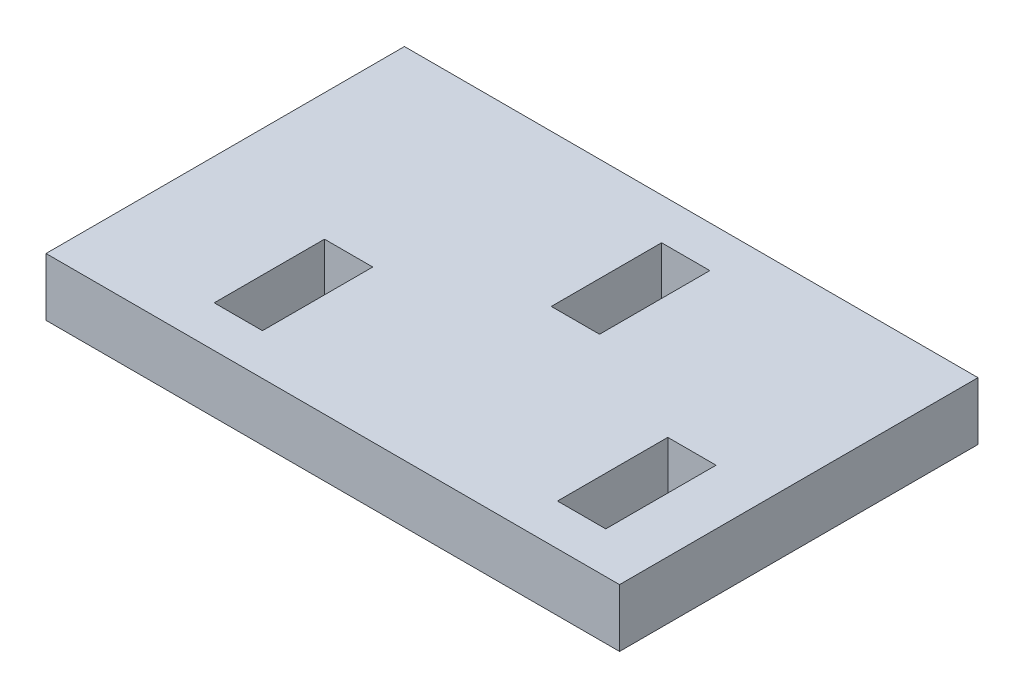
ISO-10303-21;
HEADER;
FILE_DESCRIPTION(('STEP AP214'),'2;1');
FILE_NAME('part.step','',(''),(''),'','','');
FILE_SCHEMA(('AUTOMOTIVE_DESIGN { 1 0 10303 214 1 1 1 1 }'));
ENDSEC;
DATA;
#1=APPLICATION_CONTEXT('core data for automotive mechanical design processes');
#2=APPLICATION_PROTOCOL_DEFINITION('international standard','automotive_design',2000,#1);
#3=PRODUCT_CONTEXT('',#1,'mechanical');
#4=PRODUCT('Part','Part','',(#3));
#5=PRODUCT_RELATED_PRODUCT_CATEGORY('part','',(#4));
#6=PRODUCT_DEFINITION_FORMATION('','',#4);
#7=PRODUCT_DEFINITION_CONTEXT('part definition',#1,'design');
#8=PRODUCT_DEFINITION('design','',#6,#7);
#9=PRODUCT_DEFINITION_SHAPE('','',#8);
#10=(LENGTH_UNIT() NAMED_UNIT(*) SI_UNIT(.MILLI.,.METRE.));
#11=(NAMED_UNIT(*) PLANE_ANGLE_UNIT() SI_UNIT($,.RADIAN.));
#12=(NAMED_UNIT(*) SI_UNIT($,.STERADIAN.) SOLID_ANGLE_UNIT());
#13=UNCERTAINTY_MEASURE_WITH_UNIT(LENGTH_MEASURE(1.E-05),#10,'distance_accuracy_value','');
#14=(GEOMETRIC_REPRESENTATION_CONTEXT(3) GLOBAL_UNCERTAINTY_ASSIGNED_CONTEXT((#13)) GLOBAL_UNIT_ASSIGNED_CONTEXT((#10,
#11,#12)) REPRESENTATION_CONTEXT('',''));
#15=CARTESIAN_POINT('',(0.,0.,0.));
#16=DIRECTION('',(0.,0.,1.));
#17=DIRECTION('',(1.,0.,0.));
#18=AXIS2_PLACEMENT_3D('',#15,#16,#17);
#19=CARTESIAN_POINT('',(26.416,5.334,16.51));
#20=DIRECTION('',(-1.,0.,0.));
#21=DIRECTION('',(0.,0.,1.));
#22=AXIS2_PLACEMENT_3D('',#19,#20,#21);
#23=PLANE('',#22);
#24=DIRECTION('',(0.,0.,-1.));
#25=VECTOR('',#24,1.);
#26=CARTESIAN_POINT('',(26.416,0.,16.51));
#27=LINE('',#26,#25);
#28=CARTESIAN_POINT('',(26.416,0.,16.51));
#29=VERTEX_POINT('',#28);
#30=CARTESIAN_POINT('',(26.416,0.,-16.51));
#31=VERTEX_POINT('',#30);
#32=EDGE_CURVE('E240',#29,#31,#27,.T.);
#33=ORIENTED_EDGE('',*,*,#32,.T.);
#34=DIRECTION('',(0.,-1.,0.));
#35=VECTOR('',#34,1.);
#36=CARTESIAN_POINT('',(26.416,5.334,-16.51));
#37=LINE('',#36,#35);
#38=CARTESIAN_POINT('',(26.416,5.334,-16.51));
#39=VERTEX_POINT('',#38);
#40=EDGE_CURVE('E11',#39,#31,#37,.T.);
#41=ORIENTED_EDGE('',*,*,#40,.F.);
#42=DIRECTION('',(0.,0.,-1.));
#43=VECTOR('',#42,1.);
#44=CARTESIAN_POINT('',(26.416,5.334,16.51));
#45=LINE('',#44,#43);
#46=CARTESIAN_POINT('',(26.416,5.334,16.51));
#47=VERTEX_POINT('',#46);
#48=EDGE_CURVE('E247',#47,#39,#45,.T.);
#49=ORIENTED_EDGE('',*,*,#48,.F.);
#50=DIRECTION('',(0.,-1.,0.));
#51=VECTOR('',#50,1.);
#52=CARTESIAN_POINT('',(26.416,5.334,16.51));
#53=LINE('',#52,#51);
#54=EDGE_CURVE('E257',#47,#29,#53,.T.);
#55=ORIENTED_EDGE('',*,*,#54,.T.);
#56=EDGE_LOOP('',(#33,#41,#49,#55));
#57=FACE_BOUND('',#56,.T.);
#58=ADVANCED_FACE('F34',(#57),#23,.F.);
#59=CARTESIAN_POINT('',(-26.416,5.334,-16.51));
#60=DIRECTION('',(0.,0.,1.));
#61=DIRECTION('',(1.,0.,0.));
#62=AXIS2_PLACEMENT_3D('',#59,#60,#61);
#63=PLANE('',#62);
#64=DIRECTION('',(-1.,0.,0.));
#65=VECTOR('',#64,1.);
#66=CARTESIAN_POINT('',(-26.416,0.,-16.51));
#67=LINE('',#66,#65);
#68=CARTESIAN_POINT('',(-26.416,0.,-16.51));
#69=VERTEX_POINT('',#68);
#70=EDGE_CURVE('E260',#31,#69,#67,.T.);
#71=ORIENTED_EDGE('',*,*,#70,.T.);
#72=DIRECTION('',(0.,-1.,0.));
#73=VECTOR('',#72,1.);
#74=CARTESIAN_POINT('',(-26.416,5.334,-16.51));
#75=LINE('',#74,#73);
#76=CARTESIAN_POINT('',(-26.416,5.334,-16.51));
#77=VERTEX_POINT('',#76);
#78=EDGE_CURVE('E41',#77,#69,#75,.T.);
#79=ORIENTED_EDGE('',*,*,#78,.F.);
#80=DIRECTION('',(-1.,0.,0.));
#81=VECTOR('',#80,1.);
#82=CARTESIAN_POINT('',(-26.416,5.334,-16.51));
#83=LINE('',#82,#81);
#84=EDGE_CURVE('E250',#39,#77,#83,.T.);
#85=ORIENTED_EDGE('',*,*,#84,.F.);
#86=ORIENTED_EDGE('',*,*,#40,.T.);
#87=EDGE_LOOP('',(#71,#79,#85,#86));
#88=FACE_BOUND('',#87,.T.);
#89=ADVANCED_FACE('F289',(#88),#63,.F.);
#90=CARTESIAN_POINT('',(-26.416,5.334,16.51));
#91=DIRECTION('',(1.,0.,0.));
#92=DIRECTION('',(0.,0.,-1.));
#93=AXIS2_PLACEMENT_3D('',#90,#91,#92);
#94=PLANE('',#93);
#95=DIRECTION('',(0.,0.,1.));
#96=VECTOR('',#95,1.);
#97=CARTESIAN_POINT('',(-26.416,0.,16.51));
#98=LINE('',#97,#96);
#99=CARTESIAN_POINT('',(-26.416,0.,16.51));
#100=VERTEX_POINT('',#99);
#101=EDGE_CURVE('E262',#69,#100,#98,.T.);
#102=ORIENTED_EDGE('',*,*,#101,.T.);
#103=DIRECTION('',(0.,-1.,0.));
#104=VECTOR('',#103,1.);
#105=CARTESIAN_POINT('',(-26.416,5.334,16.51));
#106=LINE('',#105,#104);
#107=CARTESIAN_POINT('',(-26.416,5.334,16.51));
#108=VERTEX_POINT('',#107);
#109=EDGE_CURVE('E267',#108,#100,#106,.T.);
#110=ORIENTED_EDGE('',*,*,#109,.F.);
#111=DIRECTION('',(0.,0.,1.));
#112=VECTOR('',#111,1.);
#113=CARTESIAN_POINT('',(-26.416,5.334,16.51));
#114=LINE('',#113,#112);
#115=EDGE_CURVE('E253',#77,#108,#114,.T.);
#116=ORIENTED_EDGE('',*,*,#115,.F.);
#117=ORIENTED_EDGE('',*,*,#78,.T.);
#118=EDGE_LOOP('',(#102,#110,#116,#117));
#119=FACE_BOUND('',#118,.T.);
#120=ADVANCED_FACE('F274',(#119),#94,.F.);
#121=CARTESIAN_POINT('',(-26.416,5.334,16.51));
#122=DIRECTION('',(0.,0.,-1.));
#123=DIRECTION('',(-1.,0.,0.));
#124=AXIS2_PLACEMENT_3D('',#121,#122,#123);
#125=PLANE('',#124);
#126=DIRECTION('',(1.,0.,0.));
#127=VECTOR('',#126,1.);
#128=CARTESIAN_POINT('',(-26.416,0.,16.51));
#129=LINE('',#128,#127);
#130=EDGE_CURVE('E251',#100,#29,#129,.T.);
#131=ORIENTED_EDGE('',*,*,#130,.T.);
#132=ORIENTED_EDGE('',*,*,#54,.F.);
#133=DIRECTION('',(1.,0.,0.));
#134=VECTOR('',#133,1.);
#135=CARTESIAN_POINT('',(-26.416,5.334,16.51));
#136=LINE('',#135,#134);
#137=EDGE_CURVE('E255',#108,#47,#136,.T.);
#138=ORIENTED_EDGE('',*,*,#137,.F.);
#139=ORIENTED_EDGE('',*,*,#109,.T.);
#140=EDGE_LOOP('',(#131,#132,#138,#139));
#141=FACE_BOUND('',#140,.T.);
#142=ADVANCED_FACE('F282',(#141),#125,.F.);
#143=CARTESIAN_POINT('',(26.416,5.334,-16.51));
#144=DIRECTION('',(0.,-1.,0.));
#145=DIRECTION('',(0.,0.,-1.));
#146=AXIS2_PLACEMENT_3D('',#143,#144,#145);
#147=PLANE('',#146);
#148=DIRECTION('',(0.,0.,1.));
#149=VECTOR('',#148,1.);
#150=CARTESIAN_POINT('',(-14.732,5.334,12.6999999999999));
#151=LINE('',#150,#149);
#152=CARTESIAN_POINT('',(-14.7319999999999,5.334,2.53999999999993));
#153=VERTEX_POINT('',#152);
#154=CARTESIAN_POINT('',(-14.732,5.334,12.6999999999999));
#155=VERTEX_POINT('',#154);
#156=EDGE_CURVE('E173',#153,#155,#151,.T.);
#157=ORIENTED_EDGE('',*,*,#156,.F.);
#158=DIRECTION('',(-1.,0.,0.));
#159=VECTOR('',#158,1.);
#160=CARTESIAN_POINT('',(-14.7319999999999,5.334,2.53999999999993));
#161=LINE('',#160,#159);
#162=CARTESIAN_POINT('',(-10.2869999999999,5.334,2.53999999999994));
#163=VERTEX_POINT('',#162);
#164=EDGE_CURVE('E48',#163,#153,#161,.T.);
#165=ORIENTED_EDGE('',*,*,#164,.F.);
#166=DIRECTION('',(0.,0.,-1.));
#167=VECTOR('',#166,1.);
#168=CARTESIAN_POINT('',(-10.2869999999999,5.334,2.53999999999994));
#169=LINE('',#168,#167);
#170=CARTESIAN_POINT('',(-10.287,5.334,12.6999999999999));
#171=VERTEX_POINT('',#170);
#172=EDGE_CURVE('E164',#171,#163,#169,.T.);
#173=ORIENTED_EDGE('',*,*,#172,.F.);
#174=DIRECTION('',(1.,0.,0.));
#175=VECTOR('',#174,1.);
#176=CARTESIAN_POINT('',(-10.287,5.334,12.6999999999999));
#177=LINE('',#176,#175);
#178=EDGE_CURVE('E167',#155,#171,#177,.T.);
#179=ORIENTED_EDGE('',*,*,#178,.F.);
#180=EDGE_LOOP('',(#157,#165,#173,#179));
#181=FACE_BOUND('',#180,.T.);
#182=DIRECTION('',(-1.,0.,0.));
#183=VECTOR('',#182,1.);
#184=CARTESIAN_POINT('',(1.07950000000005,5.334,-12.7));
#185=LINE('',#184,#183);
#186=CARTESIAN_POINT('',(5.52450000000004,5.334,-12.7));
#187=VERTEX_POINT('',#186);
#188=CARTESIAN_POINT('',(1.07950000000005,5.334,-12.7));
#189=VERTEX_POINT('',#188);
#190=EDGE_CURVE('E198',#187,#189,#185,.T.);
#191=ORIENTED_EDGE('',*,*,#190,.F.);
#192=DIRECTION('',(0.,0.,-1.));
#193=VECTOR('',#192,1.);
#194=CARTESIAN_POINT('',(5.52450000000005,5.334,-12.7));
#195=LINE('',#194,#193);
#196=CARTESIAN_POINT('',(5.52450000000004,5.334,-2.54000000000005));
#197=VERTEX_POINT('',#196);
#198=EDGE_CURVE('E179',#197,#187,#195,.T.);
#199=ORIENTED_EDGE('',*,*,#198,.F.);
#200=DIRECTION('',(1.,0.,0.));
#201=VECTOR('',#200,1.);
#202=CARTESIAN_POINT('',(5.52450000000004,5.334,-2.54000000000005));
#203=LINE('',#202,#201);
#204=CARTESIAN_POINT('',(1.07950000000004,5.334,-2.54000000000005));
#205=VERTEX_POINT('',#204);
#206=EDGE_CURVE('E187',#205,#197,#203,.T.);
#207=ORIENTED_EDGE('',*,*,#206,.F.);
#208=DIRECTION('',(0.,0.,1.));
#209=VECTOR('',#208,1.);
#210=CARTESIAN_POINT('',(1.07950000000004,5.334,-2.54000000000005));
#211=LINE('',#210,#209);
#212=EDGE_CURVE('E201',#189,#205,#211,.T.);
#213=ORIENTED_EDGE('',*,*,#212,.F.);
#214=EDGE_LOOP('',(#191,#199,#207,#213));
#215=FACE_BOUND('',#214,.T.);
#216=DIRECTION('',(0.,0.,-1.));
#217=VECTOR('',#216,1.);
#218=CARTESIAN_POINT('',(21.3360000000001,5.334,2.53999999999999));
#219=LINE('',#218,#217);
#220=CARTESIAN_POINT('',(21.336,5.334,12.7));
#221=VERTEX_POINT('',#220);
#222=CARTESIAN_POINT('',(21.3360000000001,5.334,2.53999999999999));
#223=VERTEX_POINT('',#222);
#224=EDGE_CURVE('E230',#221,#223,#219,.T.);
#225=ORIENTED_EDGE('',*,*,#224,.F.);
#226=DIRECTION('',(1.,0.,0.));
#227=VECTOR('',#226,1.);
#228=CARTESIAN_POINT('',(21.336,5.334,12.7));
#229=LINE('',#228,#227);
#230=CARTESIAN_POINT('',(16.891,5.334,12.7));
#231=VERTEX_POINT('',#230);
#232=EDGE_CURVE('E208',#231,#221,#229,.T.);
#233=ORIENTED_EDGE('',*,*,#232,.F.);
#234=DIRECTION('',(0.,0.,1.));
#235=VECTOR('',#234,1.);
#236=CARTESIAN_POINT('',(16.891,5.334,12.7));
#237=LINE('',#236,#235);
#238=CARTESIAN_POINT('',(16.8910000000001,5.334,2.53999999999999));
#239=VERTEX_POINT('',#238);
#240=EDGE_CURVE('E219',#239,#231,#237,.T.);
#241=ORIENTED_EDGE('',*,*,#240,.F.);
#242=DIRECTION('',(-1.,0.,0.));
#243=VECTOR('',#242,1.);
#244=CARTESIAN_POINT('',(16.8910000000001,5.334,2.53999999999999));
#245=LINE('',#244,#243);
#246=EDGE_CURVE('E233',#223,#239,#245,.T.);
#247=ORIENTED_EDGE('',*,*,#246,.F.);
#248=EDGE_LOOP('',(#225,#233,#241,#247));
#249=FACE_BOUND('',#248,.T.);
#250=ORIENTED_EDGE('',*,*,#48,.T.);
#251=ORIENTED_EDGE('',*,*,#84,.T.);
#252=ORIENTED_EDGE('',*,*,#115,.T.);
#253=ORIENTED_EDGE('',*,*,#137,.T.);
#254=EDGE_LOOP('',(#250,#251,#252,#253));
#255=FACE_BOUND('',#254,.T.);
#256=ADVANCED_FACE('F288',(#181,#215,#249,#255),#147,.F.);
#257=CARTESIAN_POINT('',(26.416,0.,-16.51));
#258=DIRECTION('',(0.,-1.,0.));
#259=DIRECTION('',(0.,0.,-1.));
#260=AXIS2_PLACEMENT_3D('',#257,#258,#259);
#261=PLANE('',#260);
#262=DIRECTION('',(-1.,0.,0.));
#263=VECTOR('',#262,1.);
#264=CARTESIAN_POINT('',(-14.7319999999999,0.,2.53999999999993));
#265=LINE('',#264,#263);
#266=CARTESIAN_POINT('',(-10.2869999999999,0.,2.53999999999994));
#267=VERTEX_POINT('',#266);
#268=CARTESIAN_POINT('',(-14.7319999999999,0.,2.53999999999993));
#269=VERTEX_POINT('',#268);
#270=EDGE_CURVE('E148',#267,#269,#265,.T.);
#271=ORIENTED_EDGE('',*,*,#270,.T.);
#272=DIRECTION('',(0.,0.,1.));
#273=VECTOR('',#272,1.);
#274=CARTESIAN_POINT('',(-14.732,0.,12.6999999999999));
#275=LINE('',#274,#273);
#276=CARTESIAN_POINT('',(-14.732,0.,12.6999999999999));
#277=VERTEX_POINT('',#276);
#278=EDGE_CURVE('E157',#269,#277,#275,.T.);
#279=ORIENTED_EDGE('',*,*,#278,.T.);
#280=DIRECTION('',(1.,0.,0.));
#281=VECTOR('',#280,1.);
#282=CARTESIAN_POINT('',(-10.287,0.,12.6999999999999));
#283=LINE('',#282,#281);
#284=CARTESIAN_POINT('',(-10.287,0.,12.6999999999999));
#285=VERTEX_POINT('',#284);
#286=EDGE_CURVE('E56',#277,#285,#283,.T.);
#287=ORIENTED_EDGE('',*,*,#286,.T.);
#288=DIRECTION('',(0.,0.,-1.));
#289=VECTOR('',#288,1.);
#290=CARTESIAN_POINT('',(-10.2869999999999,0.,2.53999999999994));
#291=LINE('',#290,#289);
#292=EDGE_CURVE('E154',#285,#267,#291,.T.);
#293=ORIENTED_EDGE('',*,*,#292,.T.);
#294=EDGE_LOOP('',(#271,#279,#287,#293));
#295=FACE_BOUND('',#294,.T.);
#296=DIRECTION('',(0.,0.,-1.));
#297=VECTOR('',#296,1.);
#298=CARTESIAN_POINT('',(5.52450000000005,0.,-12.7));
#299=LINE('',#298,#297);
#300=CARTESIAN_POINT('',(5.52450000000004,0.,-2.54000000000005));
#301=VERTEX_POINT('',#300);
#302=CARTESIAN_POINT('',(5.52450000000005,0.,-12.7));
#303=VERTEX_POINT('',#302);
#304=EDGE_CURVE('E183',#301,#303,#299,.T.);
#305=ORIENTED_EDGE('',*,*,#304,.T.);
#306=DIRECTION('',(-1.,0.,0.));
#307=VECTOR('',#306,1.);
#308=CARTESIAN_POINT('',(1.07950000000005,0.,-12.7));
#309=LINE('',#308,#307);
#310=CARTESIAN_POINT('',(1.07950000000005,0.,-12.7));
#311=VERTEX_POINT('',#310);
#312=EDGE_CURVE('E186',#303,#311,#309,.T.);
#313=ORIENTED_EDGE('',*,*,#312,.T.);
#314=DIRECTION('',(0.,0.,1.));
#315=VECTOR('',#314,1.);
#316=CARTESIAN_POINT('',(1.07950000000004,0.,-2.54000000000005));
#317=LINE('',#316,#315);
#318=CARTESIAN_POINT('',(1.07950000000004,0.,-2.54000000000005));
#319=VERTEX_POINT('',#318);
#320=EDGE_CURVE('E190',#311,#319,#317,.T.);
#321=ORIENTED_EDGE('',*,*,#320,.T.);
#322=DIRECTION('',(1.,0.,0.));
#323=VECTOR('',#322,1.);
#324=CARTESIAN_POINT('',(5.52450000000004,0.,-2.54000000000005));
#325=LINE('',#324,#323);
#326=EDGE_CURVE('E193',#319,#301,#325,.T.);
#327=ORIENTED_EDGE('',*,*,#326,.T.);
#328=EDGE_LOOP('',(#305,#313,#321,#327));
#329=FACE_BOUND('',#328,.T.);
#330=DIRECTION('',(1.,0.,0.));
#331=VECTOR('',#330,1.);
#332=CARTESIAN_POINT('',(21.336,0.,12.7));
#333=LINE('',#332,#331);
#334=CARTESIAN_POINT('',(16.891,0.,12.7));
#335=VERTEX_POINT('',#334);
#336=CARTESIAN_POINT('',(21.336,0.,12.7));
#337=VERTEX_POINT('',#336);
#338=EDGE_CURVE('E215',#335,#337,#333,.T.);
#339=ORIENTED_EDGE('',*,*,#338,.T.);
#340=DIRECTION('',(0.,0.,-1.));
#341=VECTOR('',#340,1.);
#342=CARTESIAN_POINT('',(21.3360000000001,0.,2.53999999999999));
#343=LINE('',#342,#341);
#344=CARTESIAN_POINT('',(21.3360000000001,0.,2.53999999999999));
#345=VERTEX_POINT('',#344);
#346=EDGE_CURVE('E218',#337,#345,#343,.T.);
#347=ORIENTED_EDGE('',*,*,#346,.T.);
#348=DIRECTION('',(-1.,0.,0.));
#349=VECTOR('',#348,1.);
#350=CARTESIAN_POINT('',(16.8910000000001,0.,2.53999999999999));
#351=LINE('',#350,#349);
#352=CARTESIAN_POINT('',(16.8910000000001,0.,2.53999999999999));
#353=VERTEX_POINT('',#352);
#354=EDGE_CURVE('E222',#345,#353,#351,.T.);
#355=ORIENTED_EDGE('',*,*,#354,.T.);
#356=DIRECTION('',(0.,0.,1.));
#357=VECTOR('',#356,1.);
#358=CARTESIAN_POINT('',(16.891,0.,12.7));
#359=LINE('',#358,#357);
#360=EDGE_CURVE('E225',#353,#335,#359,.T.);
#361=ORIENTED_EDGE('',*,*,#360,.T.);
#362=EDGE_LOOP('',(#339,#347,#355,#361));
#363=FACE_BOUND('',#362,.T.);
#364=ORIENTED_EDGE('',*,*,#32,.F.);
#365=ORIENTED_EDGE('',*,*,#130,.F.);
#366=ORIENTED_EDGE('',*,*,#101,.F.);
#367=ORIENTED_EDGE('',*,*,#70,.F.);
#368=EDGE_LOOP('',(#364,#365,#366,#367));
#369=FACE_BOUND('',#368,.T.);
#370=ADVANCED_FACE('F161',(#295,#329,#363,#369),#261,.T.);
#371=CARTESIAN_POINT('',(21.336,0.,12.7));
#372=DIRECTION('',(0.,0.,1.));
#373=DIRECTION('',(1.,0.,0.));
#374=AXIS2_PLACEMENT_3D('',#371,#372,#373);
#375=PLANE('',#374);
#376=ORIENTED_EDGE('',*,*,#232,.T.);
#377=DIRECTION('',(0.,1.,0.));
#378=VECTOR('',#377,1.);
#379=CARTESIAN_POINT('',(21.336,0.,12.7));
#380=LINE('',#379,#378);
#381=EDGE_CURVE('E228',#337,#221,#380,.T.);
#382=ORIENTED_EDGE('',*,*,#381,.F.);
#383=ORIENTED_EDGE('',*,*,#338,.F.);
#384=DIRECTION('',(0.,1.,0.));
#385=VECTOR('',#384,1.);
#386=CARTESIAN_POINT('',(16.891,0.,12.7));
#387=LINE('',#386,#385);
#388=EDGE_CURVE('E238',#335,#231,#387,.T.);
#389=ORIENTED_EDGE('',*,*,#388,.T.);
#390=EDGE_LOOP('',(#376,#382,#383,#389));
#391=FACE_BOUND('',#390,.T.);
#392=ADVANCED_FACE('F301',(#391),#375,.F.);
#393=CARTESIAN_POINT('',(16.891,0.,12.7));
#394=DIRECTION('',(-1.,0.,0.));
#395=DIRECTION('',(0.,0.,1.));
#396=AXIS2_PLACEMENT_3D('',#393,#394,#395);
#397=PLANE('',#396);
#398=ORIENTED_EDGE('',*,*,#240,.T.);
#399=ORIENTED_EDGE('',*,*,#388,.F.);
#400=ORIENTED_EDGE('',*,*,#360,.F.);
#401=DIRECTION('',(0.,1.,0.));
#402=VECTOR('',#401,1.);
#403=CARTESIAN_POINT('',(16.8910000000001,0.,2.53999999999999));
#404=LINE('',#403,#402);
#405=EDGE_CURVE('E241',#353,#239,#404,.T.);
#406=ORIENTED_EDGE('',*,*,#405,.T.);
#407=EDGE_LOOP('',(#398,#399,#400,#406));
#408=FACE_BOUND('',#407,.T.);
#409=ADVANCED_FACE('F307',(#408),#397,.F.);
#410=CARTESIAN_POINT('',(16.8910000000001,0.,2.53999999999999));
#411=DIRECTION('',(0.,0.,-1.));
#412=DIRECTION('',(-1.,0.,0.));
#413=AXIS2_PLACEMENT_3D('',#410,#411,#412);
#414=PLANE('',#413);
#415=ORIENTED_EDGE('',*,*,#246,.T.);
#416=ORIENTED_EDGE('',*,*,#405,.F.);
#417=ORIENTED_EDGE('',*,*,#354,.F.);
#418=DIRECTION('',(0.,1.,0.));
#419=VECTOR('',#418,1.);
#420=CARTESIAN_POINT('',(21.3360000000001,0.,2.53999999999999));
#421=LINE('',#420,#419);
#422=EDGE_CURVE('E243',#345,#223,#421,.T.);
#423=ORIENTED_EDGE('',*,*,#422,.T.);
#424=EDGE_LOOP('',(#415,#416,#417,#423));
#425=FACE_BOUND('',#424,.T.);
#426=ADVANCED_FACE('F313',(#425),#414,.F.);
#427=CARTESIAN_POINT('',(21.3360000000001,0.,2.53999999999999));
#428=DIRECTION('',(1.,0.,0.));
#429=DIRECTION('',(0.,0.,-1.));
#430=AXIS2_PLACEMENT_3D('',#427,#428,#429);
#431=PLANE('',#430);
#432=ORIENTED_EDGE('',*,*,#224,.T.);
#433=ORIENTED_EDGE('',*,*,#422,.F.);
#434=ORIENTED_EDGE('',*,*,#346,.F.);
#435=ORIENTED_EDGE('',*,*,#381,.T.);
#436=EDGE_LOOP('',(#432,#433,#434,#435));
#437=FACE_BOUND('',#436,.T.);
#438=ADVANCED_FACE('F309',(#437),#431,.F.);
#439=CARTESIAN_POINT('',(5.52450000000005,0.,-12.7));
#440=DIRECTION('',(1.,0.,0.));
#441=DIRECTION('',(0.,0.,-1.));
#442=AXIS2_PLACEMENT_3D('',#439,#440,#441);
#443=PLANE('',#442);
#444=ORIENTED_EDGE('',*,*,#198,.T.);
#445=DIRECTION('',(0.,1.,0.));
#446=VECTOR('',#445,1.);
#447=CARTESIAN_POINT('',(5.52450000000005,0.,-12.7));
#448=LINE('',#447,#446);
#449=EDGE_CURVE('E196',#303,#187,#448,.T.);
#450=ORIENTED_EDGE('',*,*,#449,.F.);
#451=ORIENTED_EDGE('',*,*,#304,.F.);
#452=DIRECTION('',(0.,1.,0.));
#453=VECTOR('',#452,1.);
#454=CARTESIAN_POINT('',(5.52450000000004,0.,-2.54000000000005));
#455=LINE('',#454,#453);
#456=EDGE_CURVE('E206',#301,#197,#455,.T.);
#457=ORIENTED_EDGE('',*,*,#456,.T.);
#458=EDGE_LOOP('',(#444,#450,#451,#457));
#459=FACE_BOUND('',#458,.T.);
#460=ADVANCED_FACE('F312',(#459),#443,.F.);
#461=CARTESIAN_POINT('',(5.52450000000004,0.,-2.54000000000005));
#462=DIRECTION('',(0.,0.,1.));
#463=DIRECTION('',(1.,0.,0.));
#464=AXIS2_PLACEMENT_3D('',#461,#462,#463);
#465=PLANE('',#464);
#466=ORIENTED_EDGE('',*,*,#206,.T.);
#467=ORIENTED_EDGE('',*,*,#456,.F.);
#468=ORIENTED_EDGE('',*,*,#326,.F.);
#469=DIRECTION('',(0.,1.,0.));
#470=VECTOR('',#469,1.);
#471=CARTESIAN_POINT('',(1.07950000000004,0.,-2.54000000000005));
#472=LINE('',#471,#470);
#473=EDGE_CURVE('E209',#319,#205,#472,.T.);
#474=ORIENTED_EDGE('',*,*,#473,.T.);
#475=EDGE_LOOP('',(#466,#467,#468,#474));
#476=FACE_BOUND('',#475,.T.);
#477=ADVANCED_FACE('F323',(#476),#465,.F.);
#478=CARTESIAN_POINT('',(1.07950000000004,0.,-2.54000000000005));
#479=DIRECTION('',(-1.,0.,0.));
#480=DIRECTION('',(0.,0.,1.));
#481=AXIS2_PLACEMENT_3D('',#478,#479,#480);
#482=PLANE('',#481);
#483=ORIENTED_EDGE('',*,*,#212,.T.);
#484=ORIENTED_EDGE('',*,*,#473,.F.);
#485=ORIENTED_EDGE('',*,*,#320,.F.);
#486=DIRECTION('',(0.,1.,0.));
#487=VECTOR('',#486,1.);
#488=CARTESIAN_POINT('',(1.07950000000005,0.,-12.7));
#489=LINE('',#488,#487);
#490=EDGE_CURVE('E211',#311,#189,#489,.T.);
#491=ORIENTED_EDGE('',*,*,#490,.T.);
#492=EDGE_LOOP('',(#483,#484,#485,#491));
#493=FACE_BOUND('',#492,.T.);
#494=ADVANCED_FACE('F328',(#493),#482,.F.);
#495=CARTESIAN_POINT('',(1.07950000000005,0.,-12.7));
#496=DIRECTION('',(0.,0.,-1.));
#497=DIRECTION('',(-1.,0.,0.));
#498=AXIS2_PLACEMENT_3D('',#495,#496,#497);
#499=PLANE('',#498);
#500=ORIENTED_EDGE('',*,*,#190,.T.);
#501=ORIENTED_EDGE('',*,*,#490,.F.);
#502=ORIENTED_EDGE('',*,*,#312,.F.);
#503=ORIENTED_EDGE('',*,*,#449,.T.);
#504=EDGE_LOOP('',(#500,#501,#502,#503));
#505=FACE_BOUND('',#504,.T.);
#506=ADVANCED_FACE('F325',(#505),#499,.F.);
#507=CARTESIAN_POINT('',(-14.7319999999999,0.,2.53999999999993));
#508=DIRECTION('',(0.,0.,-1.));
#509=DIRECTION('',(-1.,0.,0.));
#510=AXIS2_PLACEMENT_3D('',#507,#508,#509);
#511=PLANE('',#510);
#512=ORIENTED_EDGE('',*,*,#164,.T.);
#513=DIRECTION('',(0.,1.,0.));
#514=VECTOR('',#513,1.);
#515=CARTESIAN_POINT('',(-14.7319999999999,0.,2.53999999999993));
#516=LINE('',#515,#514);
#517=EDGE_CURVE('E144',#269,#153,#516,.T.);
#518=ORIENTED_EDGE('',*,*,#517,.F.);
#519=ORIENTED_EDGE('',*,*,#270,.F.);
#520=DIRECTION('',(0.,1.,0.));
#521=VECTOR('',#520,1.);
#522=CARTESIAN_POINT('',(-10.2869999999999,0.,2.53999999999994));
#523=LINE('',#522,#521);
#524=EDGE_CURVE('E177',#267,#163,#523,.T.);
#525=ORIENTED_EDGE('',*,*,#524,.T.);
#526=EDGE_LOOP('',(#512,#518,#519,#525));
#527=FACE_BOUND('',#526,.T.);
#528=ADVANCED_FACE('F146',(#527),#511,.F.);
#529=CARTESIAN_POINT('',(-10.2869999999999,0.,2.53999999999994));
#530=DIRECTION('',(1.,0.,0.));
#531=DIRECTION('',(0.,0.,-1.));
#532=AXIS2_PLACEMENT_3D('',#529,#530,#531);
#533=PLANE('',#532);
#534=ORIENTED_EDGE('',*,*,#172,.T.);
#535=ORIENTED_EDGE('',*,*,#524,.F.);
#536=ORIENTED_EDGE('',*,*,#292,.F.);
#537=DIRECTION('',(0.,1.,0.));
#538=VECTOR('',#537,1.);
#539=CARTESIAN_POINT('',(-10.287,0.,12.6999999999999));
#540=LINE('',#539,#538);
#541=EDGE_CURVE('E180',#285,#171,#540,.T.);
#542=ORIENTED_EDGE('',*,*,#541,.T.);
#543=EDGE_LOOP('',(#534,#535,#536,#542));
#544=FACE_BOUND('',#543,.T.);
#545=ADVANCED_FACE('F338',(#544),#533,.F.);
#546=CARTESIAN_POINT('',(-10.287,0.,12.6999999999999));
#547=DIRECTION('',(0.,0.,1.));
#548=DIRECTION('',(1.,0.,0.));
#549=AXIS2_PLACEMENT_3D('',#546,#547,#548);
#550=PLANE('',#549);
#551=ORIENTED_EDGE('',*,*,#178,.T.);
#552=ORIENTED_EDGE('',*,*,#541,.F.);
#553=ORIENTED_EDGE('',*,*,#286,.F.);
#554=DIRECTION('',(0.,1.,0.));
#555=VECTOR('',#554,1.);
#556=CARTESIAN_POINT('',(-14.732,0.,12.6999999999999));
#557=LINE('',#556,#555);
#558=EDGE_CURVE('E153',#277,#155,#557,.T.);
#559=ORIENTED_EDGE('',*,*,#558,.T.);
#560=EDGE_LOOP('',(#551,#552,#553,#559));
#561=FACE_BOUND('',#560,.T.);
#562=ADVANCED_FACE('F341',(#561),#550,.F.);
#563=CARTESIAN_POINT('',(-14.732,0.,12.6999999999999));
#564=DIRECTION('',(-1.,0.,0.));
#565=DIRECTION('',(0.,0.,1.));
#566=AXIS2_PLACEMENT_3D('',#563,#564,#565);
#567=PLANE('',#566);
#568=ORIENTED_EDGE('',*,*,#156,.T.);
#569=ORIENTED_EDGE('',*,*,#558,.F.);
#570=ORIENTED_EDGE('',*,*,#278,.F.);
#571=ORIENTED_EDGE('',*,*,#517,.T.);
#572=EDGE_LOOP('',(#568,#569,#570,#571));
#573=FACE_BOUND('',#572,.T.);
#574=ADVANCED_FACE('F158',(#573),#567,.F.);
#575=CLOSED_SHELL('',(#58,#89,#120,#142,#256,#370,#392,#409,#426,#438,#460,#477,#494,#506,#528,
#545,#562,#574));
#576=MANIFOLD_SOLID_BREP('B2',#575);
#577=ADVANCED_BREP_SHAPE_REPRESENTATION('',(#18,#576),#14);
#578=SHAPE_DEFINITION_REPRESENTATION(#9,#577);
ENDSEC;
END-ISO-10303-21;
